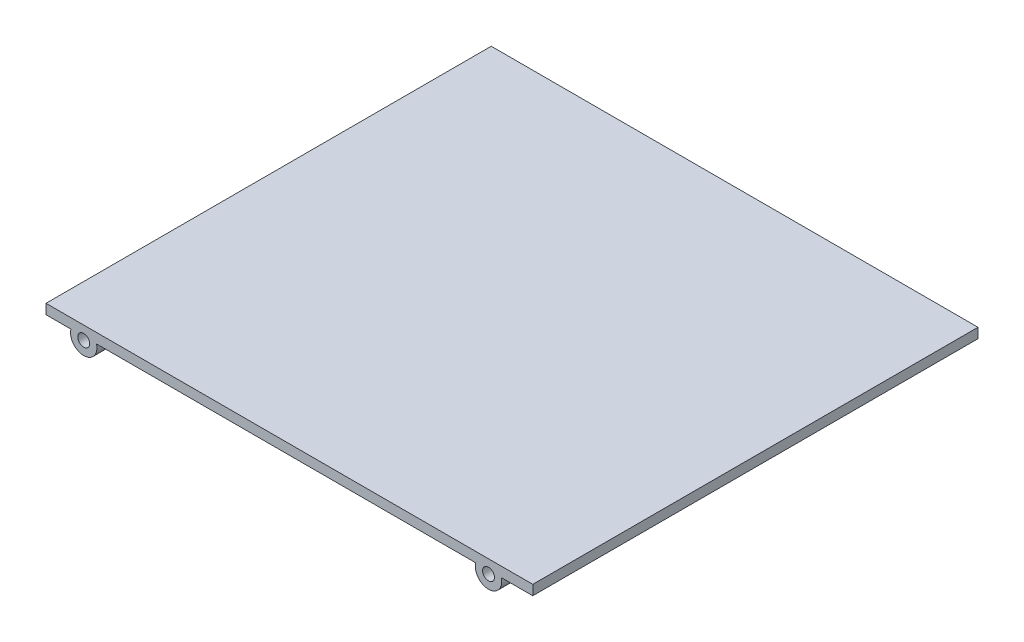
ISO-10303-21;
HEADER;
FILE_DESCRIPTION(('STEP AP214'),'2;1');
FILE_NAME('part.step','',(''),(''),'','','');
FILE_SCHEMA(('AUTOMOTIVE_DESIGN { 1 0 10303 214 1 1 1 1 }'));
ENDSEC;
DATA;
#1=APPLICATION_CONTEXT('core data for automotive mechanical design processes');
#2=APPLICATION_PROTOCOL_DEFINITION('international standard','automotive_design',2000,#1);
#3=PRODUCT_CONTEXT('',#1,'mechanical');
#4=PRODUCT('Part','Part','',(#3));
#5=PRODUCT_RELATED_PRODUCT_CATEGORY('part','',(#4));
#6=PRODUCT_DEFINITION_FORMATION('','',#4);
#7=PRODUCT_DEFINITION_CONTEXT('part definition',#1,'design');
#8=PRODUCT_DEFINITION('design','',#6,#7);
#9=PRODUCT_DEFINITION_SHAPE('','',#8);
#10=(LENGTH_UNIT() NAMED_UNIT(*) SI_UNIT(.MILLI.,.METRE.));
#11=(NAMED_UNIT(*) PLANE_ANGLE_UNIT() SI_UNIT($,.RADIAN.));
#12=(NAMED_UNIT(*) SI_UNIT($,.STERADIAN.) SOLID_ANGLE_UNIT());
#13=UNCERTAINTY_MEASURE_WITH_UNIT(LENGTH_MEASURE(1.E-05),#10,'distance_accuracy_value','');
#14=(GEOMETRIC_REPRESENTATION_CONTEXT(3) GLOBAL_UNCERTAINTY_ASSIGNED_CONTEXT((#13)) GLOBAL_UNIT_ASSIGNED_CONTEXT((#10,
#11,#12)) REPRESENTATION_CONTEXT('',''));
#15=CARTESIAN_POINT('',(0.,0.,0.));
#16=DIRECTION('',(0.,0.,1.));
#17=DIRECTION('',(1.,0.,0.));
#18=AXIS2_PLACEMENT_3D('',#15,#16,#17);
#19=CARTESIAN_POINT('',(-215.790530374135,19.6324924250548,141.061835141854));
#20=DIRECTION('',(-1.,0.,0.));
#21=DIRECTION('',(0.,0.,1.));
#22=AXIS2_PLACEMENT_3D('',#19,#20,#21);
#23=PLANE('',#22);
#24=DIRECTION('',(0.,1.,0.));
#25=VECTOR('',#24,1.);
#26=CARTESIAN_POINT('',(-215.790530374135,19.6324924250549,67.3799999999987));
#27=LINE('',#26,#25);
#28=CARTESIAN_POINT('',(-215.790530374135,18.1324924250559,67.3799999999987));
#29=VERTEX_POINT('',#28);
#30=CARTESIAN_POINT('',(-215.790530374135,19.6324924250548,67.3799999999987));
#31=VERTEX_POINT('',#30);
#32=EDGE_CURVE('E220',#29,#31,#27,.T.);
#33=ORIENTED_EDGE('',*,*,#32,.F.);
#34=DIRECTION('',(0.,0.,-1.));
#35=VECTOR('',#34,1.);
#36=CARTESIAN_POINT('',(-215.790530374135,18.1324924250559,141.061835141854));
#37=LINE('',#36,#35);
#38=CARTESIAN_POINT('',(-215.790530374135,18.1324924250559,0.));
#39=VERTEX_POINT('',#38);
#40=EDGE_CURVE('E202',#29,#39,#37,.T.);
#41=ORIENTED_EDGE('',*,*,#40,.T.);
#42=DIRECTION('',(0.,1.,0.));
#43=VECTOR('',#42,1.);
#44=CARTESIAN_POINT('',(-215.790530374135,19.6324924250548,0.));
#45=LINE('',#44,#43);
#46=CARTESIAN_POINT('',(-215.790530374135,19.6324924250548,0.));
#47=VERTEX_POINT('',#46);
#48=EDGE_CURVE('E205',#39,#47,#45,.T.);
#49=ORIENTED_EDGE('',*,*,#48,.T.);
#50=DIRECTION('',(0.,0.,-1.));
#51=VECTOR('',#50,1.);
#52=CARTESIAN_POINT('',(-215.790530374135,19.6324924250548,141.061835141854));
#53=LINE('',#52,#51);
#54=EDGE_CURVE('E215',#31,#47,#53,.T.);
#55=ORIENTED_EDGE('',*,*,#54,.F.);
#56=EDGE_LOOP('',(#33,#41,#49,#55));
#57=FACE_BOUND('',#56,.T.);
#58=ADVANCED_FACE('F39',(#57),#23,.F.);
#59=CARTESIAN_POINT('',(-289.457095584354,19.6324924250548,141.061835141854));
#60=DIRECTION('',(0.,-1.,0.));
#61=DIRECTION('',(0.,0.,-1.));
#62=AXIS2_PLACEMENT_3D('',#59,#60,#61);
#63=PLANE('',#62);
#64=DIRECTION('',(0.,0.,-1.));
#65=VECTOR('',#64,1.);
#66=CARTESIAN_POINT('',(-289.457095584354,19.6324924250548,141.061835141854));
#67=LINE('',#66,#65);
#68=CARTESIAN_POINT('',(-289.457095584354,19.6324924250548,67.3799999999987));
#69=VERTEX_POINT('',#68);
#70=CARTESIAN_POINT('',(-289.457095584354,19.6324924250548,0.));
#71=VERTEX_POINT('',#70);
#72=EDGE_CURVE('E211',#69,#71,#67,.T.);
#73=ORIENTED_EDGE('',*,*,#72,.F.);
#74=DIRECTION('',(-1.,0.,0.));
#75=VECTOR('',#74,1.);
#76=CARTESIAN_POINT('',(-289.457095584354,19.6324924250548,67.3799999999987));
#77=LINE('',#76,#75);
#78=EDGE_CURVE('E225',#31,#69,#77,.T.);
#79=ORIENTED_EDGE('',*,*,#78,.F.);
#80=ORIENTED_EDGE('',*,*,#54,.T.);
#81=DIRECTION('',(-1.,0.,0.));
#82=VECTOR('',#81,1.);
#83=CARTESIAN_POINT('',(-289.457095584354,19.6324924250548,0.));
#84=LINE('',#83,#82);
#85=EDGE_CURVE('E214',#47,#71,#84,.T.);
#86=ORIENTED_EDGE('',*,*,#85,.T.);
#87=EDGE_LOOP('',(#73,#79,#80,#86));
#88=FACE_BOUND('',#87,.T.);
#89=ADVANCED_FACE('F319',(#88),#63,.F.);
#90=CARTESIAN_POINT('',(-289.457095584354,18.132492425055,141.061835141854));
#91=DIRECTION('',(1.,0.,0.));
#92=DIRECTION('',(0.,1.,0.));
#93=AXIS2_PLACEMENT_3D('',#90,#91,#92);
#94=PLANE('',#93);
#95=DIRECTION('',(0.,-1.,0.));
#96=VECTOR('',#95,1.);
#97=CARTESIAN_POINT('',(-289.457095584354,18.1324924250551,67.3799999999987));
#98=LINE('',#97,#96);
#99=CARTESIAN_POINT('',(-289.457095584354,18.132492425055,67.3799999999987));
#100=VERTEX_POINT('',#99);
#101=EDGE_CURVE('E227',#69,#100,#98,.T.);
#102=ORIENTED_EDGE('',*,*,#101,.F.);
#103=ORIENTED_EDGE('',*,*,#72,.T.);
#104=DIRECTION('',(0.,-1.,0.));
#105=VECTOR('',#104,1.);
#106=CARTESIAN_POINT('',(-289.457095584354,18.132492425055,0.));
#107=LINE('',#106,#105);
#108=CARTESIAN_POINT('',(-289.457095584354,18.132492425055,0.));
#109=VERTEX_POINT('',#108);
#110=EDGE_CURVE('E210',#71,#109,#107,.T.);
#111=ORIENTED_EDGE('',*,*,#110,.T.);
#112=DIRECTION('',(0.,0.,-1.));
#113=VECTOR('',#112,1.);
#114=CARTESIAN_POINT('',(-289.457095584354,18.132492425055,141.061835141854));
#115=LINE('',#114,#113);
#116=EDGE_CURVE('E207',#100,#109,#115,.T.);
#117=ORIENTED_EDGE('',*,*,#116,.F.);
#118=EDGE_LOOP('',(#102,#103,#111,#117));
#119=FACE_BOUND('',#118,.T.);
#120=ADVANCED_FACE('F325',(#119),#94,.F.);
#121=CARTESIAN_POINT('',(-215.790530374135,18.1324924250559,141.061835141854));
#122=DIRECTION('',(0.,1.,0.));
#123=DIRECTION('',(-1.,0.,0.));
#124=AXIS2_PLACEMENT_3D('',#121,#122,#123);
#125=PLANE('',#124);
#126=DIRECTION('',(1.,0.,0.));
#127=VECTOR('',#126,1.);
#128=CARTESIAN_POINT('',(-215.790530374135,18.1324924250559,59.3799999999986));
#129=LINE('',#128,#127);
#130=CARTESIAN_POINT('',(-224.428044512183,18.1324924250558,59.3799999999986));
#131=VERTEX_POINT('',#130);
#132=CARTESIAN_POINT('',(-223.239884316433,18.1324924250558,59.3799999999986));
#133=VERTEX_POINT('',#132);
#134=EDGE_CURVE('E155',#131,#133,#129,.T.);
#135=ORIENTED_EDGE('',*,*,#134,.F.);
#136=DIRECTION('',(0.,0.,1.));
#137=VECTOR('',#136,1.);
#138=CARTESIAN_POINT('',(-224.428044512183,18.1324924250558,59.3799999999986));
#139=LINE('',#138,#137);
#140=CARTESIAN_POINT('',(-224.428044512183,18.1324924250558,67.3799999999986));
#141=VERTEX_POINT('',#140);
#142=EDGE_CURVE('E266',#131,#141,#139,.T.);
#143=ORIENTED_EDGE('',*,*,#142,.T.);
#144=DIRECTION('',(1.,0.,0.));
#145=VECTOR('',#144,1.);
#146=CARTESIAN_POINT('',(-215.790530374135,18.1324924250559,67.3799999999987));
#147=LINE('',#146,#145);
#148=CARTESIAN_POINT('',(-281.813961070134,18.1324924250551,67.3799999999987));
#149=VERTEX_POINT('',#148);
#150=EDGE_CURVE('E221',#149,#141,#147,.T.);
#151=ORIENTED_EDGE('',*,*,#150,.F.);
#152=DIRECTION('',(0.,0.,1.));
#153=VECTOR('',#152,1.);
#154=CARTESIAN_POINT('',(-281.813961070134,18.1324924250551,59.3799999999986));
#155=LINE('',#154,#153);
#156=CARTESIAN_POINT('',(-281.813961070134,18.1324924250551,59.3799999999986));
#157=VERTEX_POINT('',#156);
#158=EDGE_CURVE('E280',#149,#157,#155,.F.);
#159=ORIENTED_EDGE('',*,*,#158,.T.);
#160=DIRECTION('',(1.,0.,0.));
#161=VECTOR('',#160,1.);
#162=CARTESIAN_POINT('',(-215.790530374135,18.1324924250559,59.3799999999986));
#163=LINE('',#162,#161);
#164=CARTESIAN_POINT('',(-283.002121265884,18.1324924250551,59.3799999999986));
#165=VERTEX_POINT('',#164);
#166=EDGE_CURVE('E177',#165,#157,#163,.T.);
#167=ORIENTED_EDGE('',*,*,#166,.F.);
#168=CARTESIAN_POINT('',(-284.498784220593,18.1324924250551,59.3799999999986));
#169=VERTEX_POINT('',#168);
#170=EDGE_CURVE('E176',#169,#165,#163,.T.);
#171=ORIENTED_EDGE('',*,*,#170,.F.);
#172=CARTESIAN_POINT('',(-285.686944416342,18.1324924250551,59.3799999999986));
#173=VERTEX_POINT('',#172);
#174=EDGE_CURVE('E174',#173,#169,#163,.T.);
#175=ORIENTED_EDGE('',*,*,#174,.F.);
#176=DIRECTION('',(0.,0.,1.));
#177=VECTOR('',#176,1.);
#178=CARTESIAN_POINT('',(-285.686944416342,18.1324924250551,59.3799999999986));
#179=LINE('',#178,#177);
#180=CARTESIAN_POINT('',(-285.686944416342,18.1324924250551,67.3799999999986));
#181=VERTEX_POINT('',#180);
#182=EDGE_CURVE('E277',#173,#181,#179,.T.);
#183=ORIENTED_EDGE('',*,*,#182,.T.);
#184=EDGE_CURVE('E217',#100,#181,#147,.T.);
#185=ORIENTED_EDGE('',*,*,#184,.F.);
#186=ORIENTED_EDGE('',*,*,#116,.T.);
#187=DIRECTION('',(1.,0.,0.));
#188=VECTOR('',#187,1.);
#189=CARTESIAN_POINT('',(-215.790530374135,18.1324924250559,0.));
#190=LINE('',#189,#188);
#191=CARTESIAN_POINT('',(-285.686944416342,18.1324924250551,0.));
#192=VERTEX_POINT('',#191);
#193=EDGE_CURVE('E235',#109,#192,#190,.T.);
#194=ORIENTED_EDGE('',*,*,#193,.T.);
#195=DIRECTION('',(0.,0.,-1.));
#196=VECTOR('',#195,1.);
#197=CARTESIAN_POINT('',(-285.686944416342,18.1324924250551,8.));
#198=LINE('',#197,#196);
#199=CARTESIAN_POINT('',(-285.686944416342,18.1324924250551,8.));
#200=VERTEX_POINT('',#199);
#201=EDGE_CURVE('E240',#192,#200,#198,.F.);
#202=ORIENTED_EDGE('',*,*,#201,.T.);
#203=DIRECTION('',(-1.,0.,0.));
#204=VECTOR('',#203,1.);
#205=CARTESIAN_POINT('',(-215.790530374135,18.1324924250559,8.00000000000001));
#206=LINE('',#205,#204);
#207=CARTESIAN_POINT('',(-284.498784220593,18.1324924250551,8.));
#208=VERTEX_POINT('',#207);
#209=EDGE_CURVE('E197',#208,#200,#206,.T.);
#210=ORIENTED_EDGE('',*,*,#209,.F.);
#211=CARTESIAN_POINT('',(-283.002121265884,18.1324924250551,8.));
#212=VERTEX_POINT('',#211);
#213=EDGE_CURVE('E196',#212,#208,#206,.T.);
#214=ORIENTED_EDGE('',*,*,#213,.F.);
#215=CARTESIAN_POINT('',(-281.813961070134,18.1324924250551,8.));
#216=VERTEX_POINT('',#215);
#217=EDGE_CURVE('E191',#216,#212,#206,.T.);
#218=ORIENTED_EDGE('',*,*,#217,.F.);
#219=DIRECTION('',(0.,0.,-1.));
#220=VECTOR('',#219,1.);
#221=CARTESIAN_POINT('',(-281.813961070134,18.1324924250551,8.));
#222=LINE('',#221,#220);
#223=CARTESIAN_POINT('',(-281.813961070134,18.1324924250551,0.));
#224=VERTEX_POINT('',#223);
#225=EDGE_CURVE('E206',#216,#224,#222,.T.);
#226=ORIENTED_EDGE('',*,*,#225,.T.);
#227=CARTESIAN_POINT('',(-224.428044512183,18.1324924250558,0.));
#228=VERTEX_POINT('',#227);
#229=EDGE_CURVE('E237',#224,#228,#190,.T.);
#230=ORIENTED_EDGE('',*,*,#229,.T.);
#231=DIRECTION('',(0.,0.,-1.));
#232=VECTOR('',#231,1.);
#233=CARTESIAN_POINT('',(-224.428044512183,18.1324924250558,8.));
#234=LINE('',#233,#232);
#235=CARTESIAN_POINT('',(-224.428044512183,18.1324924250558,8.));
#236=VERTEX_POINT('',#235);
#237=EDGE_CURVE('E246',#228,#236,#234,.F.);
#238=ORIENTED_EDGE('',*,*,#237,.T.);
#239=DIRECTION('',(-1.,0.,0.));
#240=VECTOR('',#239,1.);
#241=CARTESIAN_POINT('',(-215.790530374135,18.1324924250559,8.00000000000001));
#242=LINE('',#241,#240);
#243=CARTESIAN_POINT('',(-223.239884316433,18.1324924250558,8.));
#244=VERTEX_POINT('',#243);
#245=EDGE_CURVE('E201',#244,#236,#242,.T.);
#246=ORIENTED_EDGE('',*,*,#245,.F.);
#247=CARTESIAN_POINT('',(-221.743221361725,18.1324924250558,8.));
#248=VERTEX_POINT('',#247);
#249=EDGE_CURVE('E200',#248,#244,#242,.T.);
#250=ORIENTED_EDGE('',*,*,#249,.F.);
#251=CARTESIAN_POINT('',(-220.555061165976,18.1324924250559,8.));
#252=VERTEX_POINT('',#251);
#253=EDGE_CURVE('E198',#252,#248,#242,.T.);
#254=ORIENTED_EDGE('',*,*,#253,.F.);
#255=DIRECTION('',(0.,0.,-1.));
#256=VECTOR('',#255,1.);
#257=CARTESIAN_POINT('',(-220.555061165976,18.1324924250559,8.));
#258=LINE('',#257,#256);
#259=CARTESIAN_POINT('',(-220.555061165976,18.1324924250559,0.));
#260=VERTEX_POINT('',#259);
#261=EDGE_CURVE('E243',#252,#260,#258,.T.);
#262=ORIENTED_EDGE('',*,*,#261,.T.);
#263=EDGE_CURVE('E209',#260,#39,#190,.T.);
#264=ORIENTED_EDGE('',*,*,#263,.T.);
#265=ORIENTED_EDGE('',*,*,#40,.F.);
#266=CARTESIAN_POINT('',(-220.555061165976,18.1324924250559,67.3799999999987));
#267=VERTEX_POINT('',#266);
#268=EDGE_CURVE('E222',#267,#29,#147,.T.);
#269=ORIENTED_EDGE('',*,*,#268,.F.);
#270=DIRECTION('',(0.,0.,1.));
#271=VECTOR('',#270,1.);
#272=CARTESIAN_POINT('',(-220.555061165976,18.1324924250559,59.3799999999986));
#273=LINE('',#272,#271);
#274=CARTESIAN_POINT('',(-220.555061165976,18.1324924250559,59.3799999999986));
#275=VERTEX_POINT('',#274);
#276=EDGE_CURVE('E275',#267,#275,#273,.F.);
#277=ORIENTED_EDGE('',*,*,#276,.T.);
#278=CARTESIAN_POINT('',(-221.743221361726,18.1324924250558,59.3799999999986));
#279=VERTEX_POINT('',#278);
#280=EDGE_CURVE('E167',#279,#275,#129,.T.);
#281=ORIENTED_EDGE('',*,*,#280,.F.);
#282=EDGE_CURVE('E159',#133,#279,#129,.T.);
#283=ORIENTED_EDGE('',*,*,#282,.F.);
#284=EDGE_LOOP('',(#135,#143,#151,#159,#167,#171,#175,#183,#185,#186,#194,#202,#210,#214,#218,
#226,#230,#238,#246,#250,#254,#262,#264,#265,#269,#277,#281,#283));
#285=FACE_BOUND('',#284,.T.);
#286=ADVANCED_FACE('F164',(#285),#125,.F.);
#287=CARTESIAN_POINT('',(0.,0.,0.));
#288=DIRECTION('',(0.,0.,-1.));
#289=DIRECTION('',(-1.,0.,0.));
#290=AXIS2_PLACEMENT_3D('',#287,#288,#289);
#291=PLANE('',#290);
#292=CARTESIAN_POINT('',(-222.491552839079,17.6324924250544,0.));
#293=DIRECTION('',(0.,0.,-1.));
#294=DIRECTION('',(-1.,0.,0.));
#295=AXIS2_PLACEMENT_3D('',#292,#293,#294);
#296=CIRCLE('',#295,0.900000000000028);
#297=CARTESIAN_POINT('',(-223.391552839079,17.6324924250544,0.));
#298=VERTEX_POINT('',#297);
#299=EDGE_CURVE('E269',#298,#298,#296,.T.);
#300=ORIENTED_EDGE('',*,*,#299,.F.);
#301=EDGE_LOOP('',(#300));
#302=FACE_BOUND('',#301,.T.);
#303=CARTESIAN_POINT('',(-283.750452743238,17.6324924250544,0.));
#304=DIRECTION('',(0.,0.,-1.));
#305=DIRECTION('',(-1.,0.,0.));
#306=AXIS2_PLACEMENT_3D('',#303,#304,#305);
#307=CIRCLE('',#306,0.900000000000001);
#308=CARTESIAN_POINT('',(-284.650452743238,17.6324924250544,0.));
#309=VERTEX_POINT('',#308);
#310=EDGE_CURVE('E265',#309,#309,#307,.T.);
#311=ORIENTED_EDGE('',*,*,#310,.F.);
#312=EDGE_LOOP('',(#311));
#313=FACE_BOUND('',#312,.T.);
#314=ORIENTED_EDGE('',*,*,#263,.F.);
#315=CARTESIAN_POINT('',(-222.49155283908,17.6324924250545,0.));
#316=DIRECTION('',(0.,0.,-1.));
#317=DIRECTION('',(-1.,0.,0.));
#318=AXIS2_PLACEMENT_3D('',#315,#316,#317);
#319=CIRCLE('',#318,2.00000000000032);
#320=EDGE_CURVE('E253',#260,#228,#319,.T.);
#321=ORIENTED_EDGE('',*,*,#320,.T.);
#322=ORIENTED_EDGE('',*,*,#229,.F.);
#323=CARTESIAN_POINT('',(-283.750452743238,17.6324924250545,0.));
#324=DIRECTION('',(0.,0.,-1.));
#325=DIRECTION('',(-1.,0.,0.));
#326=AXIS2_PLACEMENT_3D('',#323,#324,#325);
#327=CIRCLE('',#326,2.00000000000043);
#328=EDGE_CURVE('E257',#224,#192,#327,.T.);
#329=ORIENTED_EDGE('',*,*,#328,.T.);
#330=ORIENTED_EDGE('',*,*,#193,.F.);
#331=ORIENTED_EDGE('',*,*,#110,.F.);
#332=ORIENTED_EDGE('',*,*,#85,.F.);
#333=ORIENTED_EDGE('',*,*,#48,.F.);
#334=EDGE_LOOP('',(#314,#321,#322,#329,#330,#331,#332,#333));
#335=FACE_BOUND('',#334,.T.);
#336=ADVANCED_FACE('F334',(#302,#313,#335),#291,.T.);
#337=CARTESIAN_POINT('',(-53.1500000000001,-0.367507574945579,67.3799999999986));
#338=DIRECTION('',(0.,0.,1.));
#339=DIRECTION('',(0.999885624174656,-0.015124105555629,0.));
#340=AXIS2_PLACEMENT_3D('',#337,#338,#339);
#341=PLANE('',#340);
#342=CARTESIAN_POINT('',(-283.750452743238,17.6324924250543,67.3799999999986));
#343=DIRECTION('',(0.,0.,1.));
#344=DIRECTION('',(1.,0.,0.));
#345=AXIS2_PLACEMENT_3D('',#342,#343,#344);
#346=CIRCLE('',#345,0.90000000000011);
#347=CARTESIAN_POINT('',(-282.850452743238,17.6324924250543,67.3799999999986));
#348=VERTEX_POINT('',#347);
#349=EDGE_CURVE('E292',#348,#348,#346,.T.);
#350=ORIENTED_EDGE('',*,*,#349,.F.);
#351=EDGE_LOOP('',(#350));
#352=FACE_BOUND('',#351,.T.);
#353=CARTESIAN_POINT('',(-222.491552839079,17.6324924250543,67.3799999999986));
#354=DIRECTION('',(0.,0.,1.));
#355=DIRECTION('',(1.,0.,0.));
#356=AXIS2_PLACEMENT_3D('',#353,#354,#355);
#357=CIRCLE('',#356,0.90000000000011);
#358=CARTESIAN_POINT('',(-221.591552839079,17.6324924250543,67.3799999999986));
#359=VERTEX_POINT('',#358);
#360=EDGE_CURVE('E160',#359,#359,#357,.T.);
#361=ORIENTED_EDGE('',*,*,#360,.F.);
#362=EDGE_LOOP('',(#361));
#363=FACE_BOUND('',#362,.T.);
#364=ORIENTED_EDGE('',*,*,#184,.T.);
#365=CARTESIAN_POINT('',(-283.750452743238,17.6324924250543,67.3799999999986));
#366=DIRECTION('',(0.,0.,1.));
#367=DIRECTION('',(1.,0.,0.));
#368=AXIS2_PLACEMENT_3D('',#365,#366,#367);
#369=CIRCLE('',#368,2.00000000000051);
#370=EDGE_CURVE('E285',#181,#149,#369,.T.);
#371=ORIENTED_EDGE('',*,*,#370,.T.);
#372=ORIENTED_EDGE('',*,*,#150,.T.);
#373=CARTESIAN_POINT('',(-222.491552839079,17.6324924250544,67.3799999999986));
#374=DIRECTION('',(0.,0.,1.));
#375=DIRECTION('',(1.,0.,0.));
#376=AXIS2_PLACEMENT_3D('',#373,#374,#375);
#377=CIRCLE('',#376,2.00000000000037);
#378=EDGE_CURVE('E287',#141,#267,#377,.T.);
#379=ORIENTED_EDGE('',*,*,#378,.T.);
#380=ORIENTED_EDGE('',*,*,#268,.T.);
#381=ORIENTED_EDGE('',*,*,#32,.T.);
#382=ORIENTED_EDGE('',*,*,#78,.T.);
#383=ORIENTED_EDGE('',*,*,#101,.T.);
#384=EDGE_LOOP('',(#364,#371,#372,#379,#380,#381,#382,#383));
#385=FACE_BOUND('',#384,.T.);
#386=ADVANCED_FACE('F41',(#352,#363,#385),#341,.T.);
#387=CARTESIAN_POINT('',(-222.49155283908,17.6324924250545,8.));
#388=DIRECTION('',(0.,0.,-1.));
#389=DIRECTION('',(-1.,0.,0.));
#390=AXIS2_PLACEMENT_3D('',#387,#388,#389);
#391=PLANE('',#390);
#392=ORIENTED_EDGE('',*,*,#253,.T.);
#393=CARTESIAN_POINT('',(-222.491552839079,17.6324924250544,8.));
#394=DIRECTION('',(0.,0.,-1.));
#395=DIRECTION('',(-1.,0.,0.));
#396=AXIS2_PLACEMENT_3D('',#393,#394,#395);
#397=CIRCLE('',#396,0.900000000000028);
#398=EDGE_CURVE('E182',#248,#244,#397,.T.);
#399=ORIENTED_EDGE('',*,*,#398,.T.);
#400=ORIENTED_EDGE('',*,*,#245,.T.);
#401=CARTESIAN_POINT('',(-222.49155283908,17.6324924250545,8.));
#402=DIRECTION('',(0.,0.,-1.));
#403=DIRECTION('',(-1.,0.,0.));
#404=AXIS2_PLACEMENT_3D('',#401,#402,#403);
#405=CIRCLE('',#404,2.00000000000032);
#406=EDGE_CURVE('E250',#252,#236,#405,.T.);
#407=ORIENTED_EDGE('',*,*,#406,.F.);
#408=EDGE_LOOP('',(#392,#399,#400,#407));
#409=FACE_BOUND('',#408,.T.);
#410=ADVANCED_FACE('F338',(#409),#391,.F.);
#411=CARTESIAN_POINT('',(-222.49155283908,17.6324924250545,8.));
#412=DIRECTION('',(0.,0.,-1.));
#413=DIRECTION('',(-1.,0.,0.));
#414=AXIS2_PLACEMENT_3D('',#411,#412,#413);
#415=CYLINDRICAL_SURFACE('',#414,2.00000000000032);
#416=ORIENTED_EDGE('',*,*,#261,.F.);
#417=ORIENTED_EDGE('',*,*,#406,.T.);
#418=ORIENTED_EDGE('',*,*,#237,.F.);
#419=ORIENTED_EDGE('',*,*,#320,.F.);
#420=EDGE_LOOP('',(#416,#417,#418,#419));
#421=FACE_BOUND('',#420,.T.);
#422=ADVANCED_FACE('F341',(#421),#415,.T.);
#423=CARTESIAN_POINT('',(-283.750452743238,17.6324924250545,8.));
#424=DIRECTION('',(0.,0.,-1.));
#425=DIRECTION('',(-1.,0.,0.));
#426=AXIS2_PLACEMENT_3D('',#423,#424,#425);
#427=PLANE('',#426);
#428=ORIENTED_EDGE('',*,*,#217,.T.);
#429=CARTESIAN_POINT('',(-283.750452743238,17.6324924250544,8.));
#430=DIRECTION('',(0.,0.,-1.));
#431=DIRECTION('',(-1.,0.,0.));
#432=AXIS2_PLACEMENT_3D('',#429,#430,#431);
#433=CIRCLE('',#432,0.900000000000001);
#434=EDGE_CURVE('E186',#212,#208,#433,.T.);
#435=ORIENTED_EDGE('',*,*,#434,.T.);
#436=ORIENTED_EDGE('',*,*,#209,.T.);
#437=CARTESIAN_POINT('',(-283.750452743238,17.6324924250545,8.));
#438=DIRECTION('',(0.,0.,-1.));
#439=DIRECTION('',(-1.,0.,0.));
#440=AXIS2_PLACEMENT_3D('',#437,#438,#439);
#441=CIRCLE('',#440,2.00000000000043);
#442=EDGE_CURVE('E249',#216,#200,#441,.T.);
#443=ORIENTED_EDGE('',*,*,#442,.F.);
#444=EDGE_LOOP('',(#428,#435,#436,#443));
#445=FACE_BOUND('',#444,.T.);
#446=ADVANCED_FACE('F344',(#445),#427,.F.);
#447=CARTESIAN_POINT('',(-283.750452743238,17.6324924250545,8.));
#448=DIRECTION('',(0.,0.,-1.));
#449=DIRECTION('',(-1.,0.,0.));
#450=AXIS2_PLACEMENT_3D('',#447,#448,#449);
#451=CYLINDRICAL_SURFACE('',#450,2.00000000000043);
#452=ORIENTED_EDGE('',*,*,#225,.F.);
#453=ORIENTED_EDGE('',*,*,#442,.T.);
#454=ORIENTED_EDGE('',*,*,#201,.F.);
#455=ORIENTED_EDGE('',*,*,#328,.F.);
#456=EDGE_LOOP('',(#452,#453,#454,#455));
#457=FACE_BOUND('',#456,.T.);
#458=ADVANCED_FACE('F346',(#457),#451,.T.);
#459=CARTESIAN_POINT('',(-283.750452743238,17.6324924250544,8.));
#460=DIRECTION('',(0.,0.,-1.));
#461=DIRECTION('',(-1.,0.,0.));
#462=AXIS2_PLACEMENT_3D('',#459,#460,#461);
#463=PLANE('',#462);
#464=ORIENTED_EDGE('',*,*,#213,.T.);
#465=CARTESIAN_POINT('',(-283.750452743238,17.6324924250544,8.));
#466=DIRECTION('',(0.,0.,-1.));
#467=DIRECTION('',(-1.,0.,0.));
#468=AXIS2_PLACEMENT_3D('',#465,#466,#467);
#469=CIRCLE('',#468,0.900000000000001);
#470=EDGE_CURVE('E262',#208,#212,#469,.T.);
#471=ORIENTED_EDGE('',*,*,#470,.T.);
#472=EDGE_LOOP('',(#464,#471));
#473=FACE_BOUND('',#472,.T.);
#474=ADVANCED_FACE('F349',(#473),#463,.T.);
#475=CARTESIAN_POINT('',(-283.750452743238,17.6324924250544,8.));
#476=DIRECTION('',(0.,0.,-1.));
#477=DIRECTION('',(-1.,0.,0.));
#478=AXIS2_PLACEMENT_3D('',#475,#476,#477);
#479=CYLINDRICAL_SURFACE('',#478,0.900000000000001);
#480=ORIENTED_EDGE('',*,*,#470,.F.);
#481=ORIENTED_EDGE('',*,*,#434,.F.);
#482=EDGE_LOOP('',(#480,#481));
#483=FACE_BOUND('',#482,.T.);
#484=ORIENTED_EDGE('',*,*,#310,.T.);
#485=EDGE_LOOP('',(#484));
#486=FACE_BOUND('',#485,.T.);
#487=ADVANCED_FACE('F356',(#483,#486),#479,.F.);
#488=CARTESIAN_POINT('',(-222.491552839079,17.6324924250544,8.));
#489=DIRECTION('',(0.,0.,-1.));
#490=DIRECTION('',(-1.,0.,0.));
#491=AXIS2_PLACEMENT_3D('',#488,#489,#490);
#492=PLANE('',#491);
#493=ORIENTED_EDGE('',*,*,#249,.T.);
#494=CARTESIAN_POINT('',(-222.491552839079,17.6324924250544,8.));
#495=DIRECTION('',(0.,0.,-1.));
#496=DIRECTION('',(-1.,0.,0.));
#497=AXIS2_PLACEMENT_3D('',#494,#495,#496);
#498=CIRCLE('',#497,0.900000000000028);
#499=EDGE_CURVE('E254',#244,#248,#498,.T.);
#500=ORIENTED_EDGE('',*,*,#499,.T.);
#501=EDGE_LOOP('',(#493,#500));
#502=FACE_BOUND('',#501,.T.);
#503=ADVANCED_FACE('F314',(#502),#492,.T.);
#504=CARTESIAN_POINT('',(-222.491552839079,17.6324924250544,8.));
#505=DIRECTION('',(0.,0.,-1.));
#506=DIRECTION('',(-1.,0.,0.));
#507=AXIS2_PLACEMENT_3D('',#504,#505,#506);
#508=CYLINDRICAL_SURFACE('',#507,0.900000000000028);
#509=ORIENTED_EDGE('',*,*,#499,.F.);
#510=ORIENTED_EDGE('',*,*,#398,.F.);
#511=EDGE_LOOP('',(#509,#510));
#512=FACE_BOUND('',#511,.T.);
#513=ORIENTED_EDGE('',*,*,#299,.T.);
#514=EDGE_LOOP('',(#513));
#515=FACE_BOUND('',#514,.T.);
#516=ADVANCED_FACE('F305',(#512,#515),#508,.F.);
#517=CARTESIAN_POINT('',(-283.750452743238,17.6324924250543,59.3799999999986));
#518=DIRECTION('',(0.,0.,1.));
#519=DIRECTION('',(1.,0.,0.));
#520=AXIS2_PLACEMENT_3D('',#517,#518,#519);
#521=PLANE('',#520);
#522=ORIENTED_EDGE('',*,*,#174,.T.);
#523=CARTESIAN_POINT('',(-283.750452743238,17.6324924250543,59.3799999999986));
#524=DIRECTION('',(0.,0.,1.));
#525=DIRECTION('',(1.,0.,0.));
#526=AXIS2_PLACEMENT_3D('',#523,#524,#525);
#527=CIRCLE('',#526,0.90000000000011);
#528=EDGE_CURVE('E11',#169,#165,#527,.T.);
#529=ORIENTED_EDGE('',*,*,#528,.T.);
#530=ORIENTED_EDGE('',*,*,#166,.T.);
#531=CARTESIAN_POINT('',(-283.750452743238,17.6324924250543,59.3799999999986));
#532=DIRECTION('',(0.,0.,1.));
#533=DIRECTION('',(1.,0.,0.));
#534=AXIS2_PLACEMENT_3D('',#531,#532,#533);
#535=CIRCLE('',#534,2.00000000000051);
#536=EDGE_CURVE('E283',#173,#157,#535,.T.);
#537=ORIENTED_EDGE('',*,*,#536,.F.);
#538=EDGE_LOOP('',(#522,#529,#530,#537));
#539=FACE_BOUND('',#538,.T.);
#540=ADVANCED_FACE('F303',(#539),#521,.F.);
#541=CARTESIAN_POINT('',(-283.750452743238,17.6324924250543,59.3799999999986));
#542=DIRECTION('',(0.,0.,1.));
#543=DIRECTION('',(1.,0.,0.));
#544=AXIS2_PLACEMENT_3D('',#541,#542,#543);
#545=CYLINDRICAL_SURFACE('',#544,2.00000000000051);
#546=ORIENTED_EDGE('',*,*,#182,.F.);
#547=ORIENTED_EDGE('',*,*,#536,.T.);
#548=ORIENTED_EDGE('',*,*,#158,.F.);
#549=ORIENTED_EDGE('',*,*,#370,.F.);
#550=EDGE_LOOP('',(#546,#547,#548,#549));
#551=FACE_BOUND('',#550,.T.);
#552=ADVANCED_FACE('F302',(#551),#545,.T.);
#553=CARTESIAN_POINT('',(-222.491552839079,17.6324924250544,59.3799999999986));
#554=DIRECTION('',(0.,0.,1.));
#555=DIRECTION('',(1.,0.,0.));
#556=AXIS2_PLACEMENT_3D('',#553,#554,#555);
#557=PLANE('',#556);
#558=ORIENTED_EDGE('',*,*,#134,.T.);
#559=CARTESIAN_POINT('',(-222.491552839079,17.6324924250543,59.3799999999986));
#560=DIRECTION('',(0.,0.,1.));
#561=DIRECTION('',(1.,0.,0.));
#562=AXIS2_PLACEMENT_3D('',#559,#560,#561);
#563=CIRCLE('',#562,0.90000000000011);
#564=EDGE_CURVE('E47',#133,#279,#563,.T.);
#565=ORIENTED_EDGE('',*,*,#564,.T.);
#566=ORIENTED_EDGE('',*,*,#280,.T.);
#567=CARTESIAN_POINT('',(-222.491552839079,17.6324924250544,59.3799999999986));
#568=DIRECTION('',(0.,0.,1.));
#569=DIRECTION('',(1.,0.,0.));
#570=AXIS2_PLACEMENT_3D('',#567,#568,#569);
#571=CIRCLE('',#570,2.00000000000037);
#572=EDGE_CURVE('E172',#131,#275,#571,.T.);
#573=ORIENTED_EDGE('',*,*,#572,.F.);
#574=EDGE_LOOP('',(#558,#565,#566,#573));
#575=FACE_BOUND('',#574,.T.);
#576=ADVANCED_FACE('F170',(#575),#557,.F.);
#577=CARTESIAN_POINT('',(-222.491552839079,17.6324924250544,59.3799999999986));
#578=DIRECTION('',(0.,0.,1.));
#579=DIRECTION('',(1.,0.,0.));
#580=AXIS2_PLACEMENT_3D('',#577,#578,#579);
#581=CYLINDRICAL_SURFACE('',#580,2.00000000000037);
#582=ORIENTED_EDGE('',*,*,#142,.F.);
#583=ORIENTED_EDGE('',*,*,#572,.T.);
#584=ORIENTED_EDGE('',*,*,#276,.F.);
#585=ORIENTED_EDGE('',*,*,#378,.F.);
#586=EDGE_LOOP('',(#582,#583,#584,#585));
#587=FACE_BOUND('',#586,.T.);
#588=ADVANCED_FACE('F384',(#587),#581,.T.);
#589=CARTESIAN_POINT('',(-222.491552839079,17.6324924250543,59.3799999999986));
#590=DIRECTION('',(0.,0.,1.));
#591=DIRECTION('',(1.,0.,0.));
#592=AXIS2_PLACEMENT_3D('',#589,#590,#591);
#593=PLANE('',#592);
#594=ORIENTED_EDGE('',*,*,#282,.T.);
#595=CARTESIAN_POINT('',(-222.491552839079,17.6324924250543,59.3799999999986));
#596=DIRECTION('',(0.,0.,1.));
#597=DIRECTION('',(1.,0.,0.));
#598=AXIS2_PLACEMENT_3D('',#595,#596,#597);
#599=CIRCLE('',#598,0.90000000000011);
#600=EDGE_CURVE('E60',#279,#133,#599,.T.);
#601=ORIENTED_EDGE('',*,*,#600,.T.);
#602=EDGE_LOOP('',(#594,#601));
#603=FACE_BOUND('',#602,.T.);
#604=ADVANCED_FACE('F158',(#603),#593,.T.);
#605=CARTESIAN_POINT('',(-222.491552839079,17.6324924250543,59.3799999999986));
#606=DIRECTION('',(0.,0.,1.));
#607=DIRECTION('',(1.,0.,0.));
#608=AXIS2_PLACEMENT_3D('',#605,#606,#607);
#609=CYLINDRICAL_SURFACE('',#608,0.90000000000011);
#610=ORIENTED_EDGE('',*,*,#600,.F.);
#611=ORIENTED_EDGE('',*,*,#564,.F.);
#612=EDGE_LOOP('',(#610,#611));
#613=FACE_BOUND('',#612,.T.);
#614=ORIENTED_EDGE('',*,*,#360,.T.);
#615=EDGE_LOOP('',(#614));
#616=FACE_BOUND('',#615,.T.);
#617=ADVANCED_FACE('F150',(#613,#616),#609,.F.);
#618=CARTESIAN_POINT('',(-283.750452743238,17.6324924250543,59.3799999999986));
#619=DIRECTION('',(0.,0.,1.));
#620=DIRECTION('',(1.,0.,0.));
#621=AXIS2_PLACEMENT_3D('',#618,#619,#620);
#622=PLANE('',#621);
#623=ORIENTED_EDGE('',*,*,#170,.T.);
#624=CARTESIAN_POINT('',(-283.750452743238,17.6324924250543,59.3799999999986));
#625=DIRECTION('',(0.,0.,1.));
#626=DIRECTION('',(1.,0.,0.));
#627=AXIS2_PLACEMENT_3D('',#624,#625,#626);
#628=CIRCLE('',#627,0.90000000000011);
#629=EDGE_CURVE('E53',#165,#169,#628,.T.);
#630=ORIENTED_EDGE('',*,*,#629,.T.);
#631=EDGE_LOOP('',(#623,#630));
#632=FACE_BOUND('',#631,.T.);
#633=ADVANCED_FACE('F297',(#632),#622,.T.);
#634=CARTESIAN_POINT('',(-283.750452743238,17.6324924250543,59.3799999999986));
#635=DIRECTION('',(0.,0.,1.));
#636=DIRECTION('',(1.,0.,0.));
#637=AXIS2_PLACEMENT_3D('',#634,#635,#636);
#638=CYLINDRICAL_SURFACE('',#637,0.90000000000011);
#639=ORIENTED_EDGE('',*,*,#629,.F.);
#640=ORIENTED_EDGE('',*,*,#528,.F.);
#641=EDGE_LOOP('',(#639,#640));
#642=FACE_BOUND('',#641,.T.);
#643=ORIENTED_EDGE('',*,*,#349,.T.);
#644=EDGE_LOOP('',(#643));
#645=FACE_BOUND('',#644,.T.);
#646=ADVANCED_FACE('F395',(#642,#645),#638,.F.);
#647=CLOSED_SHELL('',(#58,#89,#120,#286,#336,#386,#410,#422,#446,#458,#474,#487,#503,#516,#540,
#552,#576,#588,#604,#617,#633,#646));
#648=MANIFOLD_SOLID_BREP('B2',#647);
#649=ADVANCED_BREP_SHAPE_REPRESENTATION('',(#18,#648),#14);
#650=SHAPE_DEFINITION_REPRESENTATION(#9,#649);
ENDSEC;
END-ISO-10303-21;
